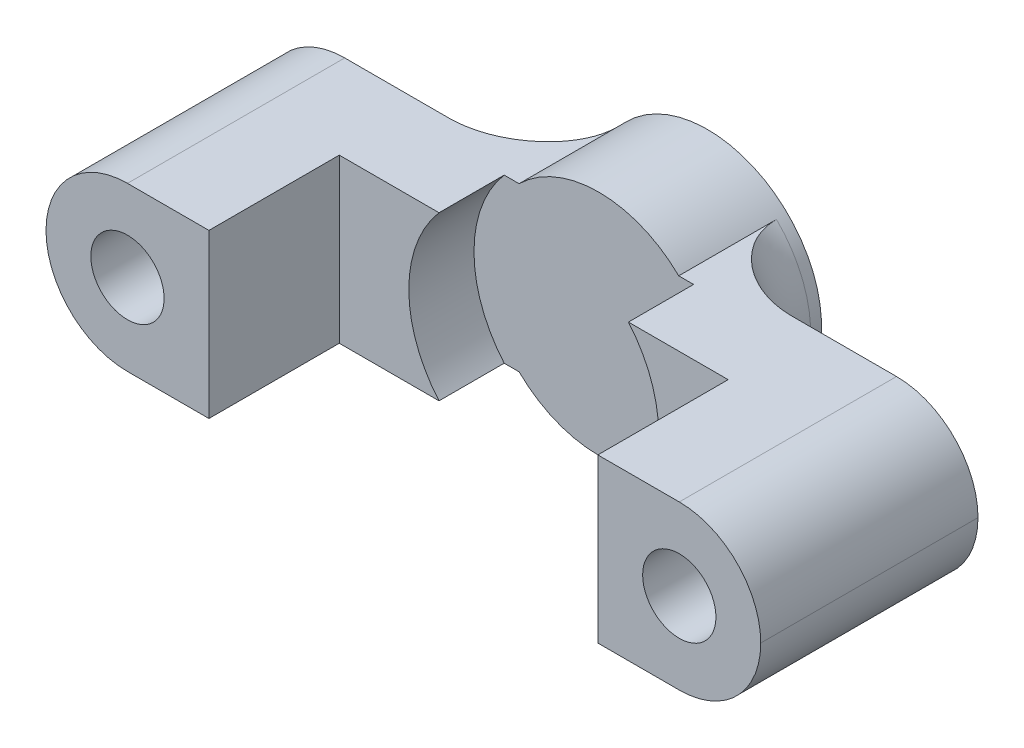
ISO-10303-21;
HEADER;
FILE_DESCRIPTION(('STEP AP214'),'2;1');
FILE_NAME('part.step','',(''),(''),'','','');
FILE_SCHEMA(('AUTOMOTIVE_DESIGN { 1 0 10303 214 1 1 1 1 }'));
ENDSEC;
DATA;
#1=APPLICATION_CONTEXT('core data for automotive mechanical design processes');
#2=APPLICATION_PROTOCOL_DEFINITION('international standard','automotive_design',2000,#1);
#3=PRODUCT_CONTEXT('',#1,'mechanical');
#4=PRODUCT('Part','Part','',(#3));
#5=PRODUCT_RELATED_PRODUCT_CATEGORY('part','',(#4));
#6=PRODUCT_DEFINITION_FORMATION('','',#4);
#7=PRODUCT_DEFINITION_CONTEXT('part definition',#1,'design');
#8=PRODUCT_DEFINITION('design','',#6,#7);
#9=PRODUCT_DEFINITION_SHAPE('','',#8);
#10=(LENGTH_UNIT() NAMED_UNIT(*) SI_UNIT(.MILLI.,.METRE.));
#11=(NAMED_UNIT(*) PLANE_ANGLE_UNIT() SI_UNIT($,.RADIAN.));
#12=(NAMED_UNIT(*) SI_UNIT($,.STERADIAN.) SOLID_ANGLE_UNIT());
#13=UNCERTAINTY_MEASURE_WITH_UNIT(LENGTH_MEASURE(1.E-05),#10,'distance_accuracy_value','');
#14=(GEOMETRIC_REPRESENTATION_CONTEXT(3) GLOBAL_UNCERTAINTY_ASSIGNED_CONTEXT((#13)) GLOBAL_UNIT_ASSIGNED_CONTEXT((#10,
#11,#12)) REPRESENTATION_CONTEXT('',''));
#15=CARTESIAN_POINT('',(0.,0.,0.));
#16=DIRECTION('',(0.,0.,1.));
#17=DIRECTION('',(1.,0.,0.));
#18=AXIS2_PLACEMENT_3D('',#15,#16,#17);
#19=CARTESIAN_POINT('',(0.,-7.5,6.));
#20=DIRECTION('',(0.,1.,0.));
#21=DIRECTION('',(-1.,0.,0.));
#22=AXIS2_PLACEMENT_3D('',#19,#20,#21);
#23=PLANE('',#22);
#24=DIRECTION('',(-1.,0.,0.));
#25=VECTOR('',#24,1.);
#26=CARTESIAN_POINT('',(-17.9,-7.5,18.));
#27=LINE('',#26,#25);
#28=CARTESIAN_POINT('',(-17.9,-7.5,18.));
#29=VERTEX_POINT('',#28);
#30=CARTESIAN_POINT('',(-25.4,-7.5,18.));
#31=VERTEX_POINT('',#30);
#32=EDGE_CURVE('E172',#29,#31,#27,.T.);
#33=ORIENTED_EDGE('',*,*,#32,.T.);
#34=DIRECTION('',(0.,0.,-1.));
#35=VECTOR('',#34,1.);
#36=CARTESIAN_POINT('',(-25.4,-7.50000000000001,-2.));
#37=LINE('',#36,#35);
#38=CARTESIAN_POINT('',(-25.4,-7.50000000000001,-2.));
#39=VERTEX_POINT('',#38);
#40=EDGE_CURVE('E11',#31,#39,#37,.T.);
#41=ORIENTED_EDGE('',*,*,#40,.T.);
#42=DIRECTION('',(-1.,0.,0.));
#43=VECTOR('',#42,1.);
#44=CARTESIAN_POINT('',(0.,-7.5,-2.));
#45=LINE('',#44,#43);
#46=CARTESIAN_POINT('',(-15.8113883008419,-7.50000000000001,-2.));
#47=VERTEX_POINT('',#46);
#48=EDGE_CURVE('E262',#47,#39,#45,.T.);
#49=ORIENTED_EDGE('',*,*,#48,.F.);
#50=CARTESIAN_POINT('',(-15.8113883008419,-7.50000000000001,-2.));
#51=CARTESIAN_POINT('',(-15.5111239041793,-7.50000000000001,-1.99996641057662));
#52=CARTESIAN_POINT('',(-15.2109687289218,-7.50000000000001,-2.01576753830129));
#53=CARTESIAN_POINT('',(-14.6139627616125,-7.50000000000001,-2.07775044445183));
#54=CARTESIAN_POINT('',(-14.3171102379921,-7.50000000000001,-2.12391545809045));
#55=CARTESIAN_POINT('',(-13.730255359878,-7.50000000000001,-2.24517532848181));
#56=CARTESIAN_POINT('',(-13.4402365981714,-7.50000000000001,-2.32019131617962));
#57=CARTESIAN_POINT('',(-12.8687734606911,-7.50000000000001,-2.49777186141323));
#58=CARTESIAN_POINT('',(-12.5873289939449,-7.5,-2.60033612655079));
#59=CARTESIAN_POINT('',(-12.0769756408679,-7.5,-2.81423888524928));
#60=CARTESIAN_POINT('',(-11.8465348158025,-7.5,-2.92193390077769));
#61=CARTESIAN_POINT('',(-11.3951202612077,-7.5,-3.15537140744996));
#62=CARTESIAN_POINT('',(-11.174145621985,-7.5,-3.28111215933743));
#63=CARTESIAN_POINT('',(-10.5272158178604,-7.5,-3.68461884827065));
#64=CARTESIAN_POINT('',(-10.1170057774989,-7.5,-3.98877368333062));
#65=CARTESIAN_POINT('',(-9.57836154411668,-7.5,-4.46435198921044));
#66=CARTESIAN_POINT('',(-9.42564782360673,-7.5,-4.6091367620679));
#67=CARTESIAN_POINT('',(-9.1313546339511,-7.5,-4.90972591721626));
#68=CARTESIAN_POINT('',(-8.98977518945814,-7.5,-5.06553032390458));
#69=CARTESIAN_POINT('',(-8.71957782035555,-7.5,-5.3876970946932));
#70=CARTESIAN_POINT('',(-8.59094332907156,-7.5,-5.55404550846774));
#71=CARTESIAN_POINT('',(-8.34839454888323,-7.5,-5.89713643002903));
#72=CARTESIAN_POINT('',(-8.23448136298089,-7.5,-6.07387971521531));
#73=CARTESIAN_POINT('',(-7.97156492092385,-7.5,-6.52738404360751));
#74=CARTESIAN_POINT('',(-7.83300471361881,-7.5,-6.81044271759455));
#75=CARTESIAN_POINT('',(-7.66101118734917,-7.5,-7.24844757806561));
#76=CARTESIAN_POINT('',(-7.60968777854708,-7.5,-7.39653135324657));
#77=CARTESIAN_POINT('',(-7.52001630855136,-7.5,-7.69655652277491));
#78=CARTESIAN_POINT('',(-7.48166282316097,-7.5,-7.84849627584848));
#79=CARTESIAN_POINT('',(-7.41680290008474,-7.5,-8.16582729639395));
#80=CARTESIAN_POINT('',(-7.39129091900108,-7.5,-8.33142577040719));
#81=CARTESIAN_POINT('',(-7.36565909923045,-7.5,-8.5812351389004));
#82=CARTESIAN_POINT('',(-7.35922108005593,-7.5,-8.66483749543803));
#83=CARTESIAN_POINT('',(-7.35062351775363,-7.5,-8.8322880713893));
#84=CARTESIAN_POINT('',(-7.34846532400768,-7.5,-8.91613636000045));
#85=CARTESIAN_POINT('',(-7.34846922834953,-7.5,-9.));
#86=B_SPLINE_CURVE_WITH_KNOTS('',3,(#50,#51,#52,#53,#54,#55,#56,#57,#58,#59,#60,#61,#62,#63,#64,
#65,#66,#67,#68,#69,#70,#71,#72,#73,#74,#75,#76,#77,#78,#79,#80,#81,#82,#83,#84,#85),
.UNSPECIFIED.,.F.,.F.,(4,2,2,2,2,2,2,2,2,2,2,2,2,2,2,2,2,4),(0.,0.900220551160631,
1.79994448106245,2.69722614648008,3.59449828849979,4.35673435874442,5.11889701360015,
6.64242071372978,7.27333848039395,7.90425764395192,8.53435881848733,9.16450717636569,
10.1057748576448,10.5754749523131,11.0449783684349,11.5467242666904,11.7981782174579,
12.0497114362907),.UNSPECIFIED.);
#87=CARTESIAN_POINT('',(-7.34846922834953,-7.5,-9.));
#88=VERTEX_POINT('',#87);
#89=EDGE_CURVE('E307',#47,#88,#86,.T.);
#90=ORIENTED_EDGE('',*,*,#89,.T.);
#91=DIRECTION('',(0.,0.,-1.));
#92=VECTOR('',#91,1.);
#93=CARTESIAN_POINT('',(-7.34846922834953,-7.5,0.));
#94=LINE('',#93,#92);
#95=CARTESIAN_POINT('',(-7.34846922834953,-7.5,0.));
#96=VERTEX_POINT('',#95);
#97=EDGE_CURVE('E239',#88,#96,#94,.F.);
#98=ORIENTED_EDGE('',*,*,#97,.T.);
#99=DIRECTION('',(-1.,0.,0.));
#100=VECTOR('',#99,1.);
#101=CARTESIAN_POINT('',(0.,-7.5,0.));
#102=LINE('',#101,#100);
#103=CARTESIAN_POINT('',(-8.71779788708134,-7.5,0.));
#104=VERTEX_POINT('',#103);
#105=EDGE_CURVE('E258',#96,#104,#102,.T.);
#106=ORIENTED_EDGE('',*,*,#105,.T.);
#107=DIRECTION('',(0.,0.,-1.));
#108=VECTOR('',#107,1.);
#109=CARTESIAN_POINT('',(-8.71779788708134,-7.5,6.));
#110=LINE('',#109,#108);
#111=CARTESIAN_POINT('',(-8.71779788708134,-7.5,6.));
#112=VERTEX_POINT('',#111);
#113=EDGE_CURVE('E251',#112,#104,#110,.T.);
#114=ORIENTED_EDGE('',*,*,#113,.F.);
#115=DIRECTION('',(1.,0.,0.));
#116=VECTOR('',#115,1.);
#117=CARTESIAN_POINT('',(0.,-7.5,6.));
#118=LINE('',#117,#116);
#119=CARTESIAN_POINT('',(-17.9,-7.50000000000001,6.));
#120=VERTEX_POINT('',#119);
#121=EDGE_CURVE('E175',#120,#112,#118,.T.);
#122=ORIENTED_EDGE('',*,*,#121,.F.);
#123=DIRECTION('',(0.,0.,-1.));
#124=VECTOR('',#123,1.);
#125=CARTESIAN_POINT('',(-17.9,-7.5,18.));
#126=LINE('',#125,#124);
#127=EDGE_CURVE('E171',#29,#120,#126,.T.);
#128=ORIENTED_EDGE('',*,*,#127,.F.);
#129=EDGE_LOOP('',(#33,#41,#49,#90,#98,#106,#114,#122,#128));
#130=FACE_BOUND('',#129,.T.);
#131=ADVANCED_FACE('F36',(#130),#23,.F.);
#132=CARTESIAN_POINT('',(0.,7.50000000000001,6.));
#133=DIRECTION('',(0.,1.,0.));
#134=DIRECTION('',(0.,0.,1.));
#135=AXIS2_PLACEMENT_3D('',#132,#133,#134);
#136=PLANE('',#135);
#137=DIRECTION('',(1.,0.,0.));
#138=VECTOR('',#137,1.);
#139=CARTESIAN_POINT('',(0.,7.50000000000001,-2.));
#140=LINE('',#139,#138);
#141=CARTESIAN_POINT('',(-25.4,7.50000000000001,-2.));
#142=VERTEX_POINT('',#141);
#143=CARTESIAN_POINT('',(-15.8113883008419,7.50000000000001,-2.));
#144=VERTEX_POINT('',#143);
#145=EDGE_CURVE('E263',#142,#144,#140,.T.);
#146=ORIENTED_EDGE('',*,*,#145,.F.);
#147=DIRECTION('',(0.,0.,-1.));
#148=VECTOR('',#147,1.);
#149=CARTESIAN_POINT('',(-25.4,7.50000000000001,6.));
#150=LINE('',#149,#148);
#151=CARTESIAN_POINT('',(-25.4,7.5,18.));
#152=VERTEX_POINT('',#151);
#153=EDGE_CURVE('E408',#142,#152,#150,.F.);
#154=ORIENTED_EDGE('',*,*,#153,.T.);
#155=DIRECTION('',(1.,0.,0.));
#156=VECTOR('',#155,1.);
#157=CARTESIAN_POINT('',(-17.9,7.5,18.));
#158=LINE('',#157,#156);
#159=CARTESIAN_POINT('',(-17.9,7.5,18.));
#160=VERTEX_POINT('',#159);
#161=EDGE_CURVE('E190',#152,#160,#158,.T.);
#162=ORIENTED_EDGE('',*,*,#161,.T.);
#163=DIRECTION('',(0.,0.,-1.));
#164=VECTOR('',#163,1.);
#165=CARTESIAN_POINT('',(-17.9,7.5,18.));
#166=LINE('',#165,#164);
#167=CARTESIAN_POINT('',(-17.9,7.5,6.));
#168=VERTEX_POINT('',#167);
#169=EDGE_CURVE('E181',#160,#168,#166,.T.);
#170=ORIENTED_EDGE('',*,*,#169,.T.);
#171=DIRECTION('',(1.,0.,0.));
#172=VECTOR('',#171,1.);
#173=CARTESIAN_POINT('',(0.,7.50000000000001,6.));
#174=LINE('',#173,#172);
#175=CARTESIAN_POINT('',(-8.71779788708134,7.50000000000001,6.));
#176=VERTEX_POINT('',#175);
#177=EDGE_CURVE('E248',#168,#176,#174,.T.);
#178=ORIENTED_EDGE('',*,*,#177,.T.);
#179=DIRECTION('',(0.,0.,-1.));
#180=VECTOR('',#179,1.);
#181=CARTESIAN_POINT('',(-8.71779788708134,7.50000000000001,6.));
#182=LINE('',#181,#180);
#183=CARTESIAN_POINT('',(-8.71779788708134,7.50000000000001,0.));
#184=VERTEX_POINT('',#183);
#185=EDGE_CURVE('E256',#176,#184,#182,.T.);
#186=ORIENTED_EDGE('',*,*,#185,.T.);
#187=DIRECTION('',(1.,0.,0.));
#188=VECTOR('',#187,1.);
#189=CARTESIAN_POINT('',(0.,7.50000000000001,0.));
#190=LINE('',#189,#188);
#191=CARTESIAN_POINT('',(-7.34846922834952,7.50000000000001,0.));
#192=VERTEX_POINT('',#191);
#193=EDGE_CURVE('E270',#184,#192,#190,.T.);
#194=ORIENTED_EDGE('',*,*,#193,.T.);
#195=DIRECTION('',(0.,0.,-1.));
#196=VECTOR('',#195,1.);
#197=CARTESIAN_POINT('',(-7.34846922834952,7.50000000000001,0.));
#198=LINE('',#197,#196);
#199=CARTESIAN_POINT('',(-7.34846922834952,7.50000000000001,-9.));
#200=VERTEX_POINT('',#199);
#201=EDGE_CURVE('E235',#200,#192,#198,.F.);
#202=ORIENTED_EDGE('',*,*,#201,.F.);
#203=CARTESIAN_POINT('',(-7.34846922834952,7.50000000000001,-9.));
#204=CARTESIAN_POINT('',(-7.34846568846636,7.50000000000001,-8.91798387331253));
#205=CARTESIAN_POINT('',(-7.3505296304595,7.50000000000001,-8.83598201308874));
#206=CARTESIAN_POINT('',(-7.35875402902435,7.50000000000001,-8.67219208531857));
#207=CARTESIAN_POINT('',(-7.36491406965228,7.50000000000001,-8.59040399691095));
#208=CARTESIAN_POINT('',(-7.38945435270717,7.50000000000001,-8.34588184444658));
#209=CARTESIAN_POINT('',(-7.41389501835498,7.50000000000001,-8.18371875453255));
#210=CARTESIAN_POINT('',(-7.47777934195556,7.50000000000001,-7.86432127919843));
#211=CARTESIAN_POINT('',(-7.517051823679,7.50000000000001,-7.7070520276216));
#212=CARTESIAN_POINT('',(-7.60949384995337,7.50000000000001,-7.39662221557643));
#213=CARTESIAN_POINT('',(-7.66266759134817,7.50000000000001,-7.24346291134076));
#214=CARTESIAN_POINT('',(-7.78128009466701,7.50000000000001,-6.94297950522702));
#215=CARTESIAN_POINT('',(-7.84664895793192,7.50000000000001,-6.79562767461401));
#216=CARTESIAN_POINT('',(-7.98853188649418,7.50000000000001,-6.50646077783094));
#217=CARTESIAN_POINT('',(-8.06504516671019,7.50000000000001,-6.36464532253613));
#218=CARTESIAN_POINT('',(-8.31007112292304,7.50000000000001,-5.94704456847047));
#219=CARTESIAN_POINT('',(-8.49370703196581,7.50000000000001,-5.67999320650892));
#220=CARTESIAN_POINT('',(-8.84142061398073,7.50000000000001,-5.23666507103636));
#221=CARTESIAN_POINT('',(-8.99842050394498,7.50000000000001,-5.05468236363742));
#222=CARTESIAN_POINT('',(-9.32759039937044,7.50000000000001,-4.70483651118266));
#223=CARTESIAN_POINT('',(-9.49976626127,7.50000000000001,-4.53697886629279));
#224=CARTESIAN_POINT('',(-9.8573107348156,7.50000000000001,-4.2157202705409));
#225=CARTESIAN_POINT('',(-10.04268910884,7.50000000000001,-4.06233021644076));
#226=CARTESIAN_POINT('',(-10.4248008827629,7.50000000000001,-3.77057512454829));
#227=CARTESIAN_POINT('',(-10.6215329039661,7.50000000000001,-3.63220826831506));
#228=CARTESIAN_POINT('',(-11.2329917900934,7.50000000000001,-3.23623671008573));
#229=CARTESIAN_POINT('',(-11.6635789981935,7.50000000000001,-3.00257620051733));
#230=CARTESIAN_POINT('',(-12.5547350230472,7.50000000000001,-2.60448842003765));
#231=CARTESIAN_POINT('',(-13.0152584463791,7.50000000000001,-2.43995902583837));
#232=CARTESIAN_POINT('',(-13.8643504408079,7.50000000000001,-2.2104014994316));
#233=CARTESIAN_POINT('',(-14.2493527598562,7.50000000000001,-2.13219880824697));
#234=CARTESIAN_POINT('',(-14.8320939828657,7.50000000000001,-2.05329287399561));
#235=CARTESIAN_POINT('',(-15.0273622419289,7.50000000000001,-2.03339009580765));
#236=CARTESIAN_POINT('',(-15.4188608707121,7.50000000000001,-2.00674146844548));
#237=CARTESIAN_POINT('',(-15.6150915558276,7.50000000000001,-2.00000026778783));
#238=CARTESIAN_POINT('',(-15.8113883008419,7.50000000000001,-2.));
#239=B_SPLINE_CURVE_WITH_KNOTS('',3,(#203,#204,#205,#206,#207,#208,#209,#210,#211,#212,#213,
#214,#215,#216,#217,#218,#219,#220,#221,#222,#223,#224,#225,#226,#227,#228,#229,#230,#231,#232,
#233,#234,#235,#236,#237,#238),.UNSPECIFIED.,.F.,.F.,(4,2,2,2,2,2,2,2,2,2,2,2,2,2,2,2,2,4),(0.,
0.245994568656017,0.491964161280957,0.983093595597821,1.46871995222198,1.95449309096537,
2.43756301288391,2.92059892082683,3.88952188731617,4.60975197145831,5.33026122100562,
6.05130888424283,6.77226917275713,8.23566971123128,9.69690078931857,10.8720277984782,
11.4604734809979,12.0491269581397),.UNSPECIFIED.);
#240=EDGE_CURVE('E298',#200,#144,#239,.T.);
#241=ORIENTED_EDGE('',*,*,#240,.T.);
#242=EDGE_LOOP('',(#146,#154,#162,#170,#178,#186,#194,#202,#241));
#243=FACE_BOUND('',#242,.T.);
#244=ADVANCED_FACE('F318',(#243),#136,.T.);
#245=CARTESIAN_POINT('',(0.,0.,-2.));
#246=DIRECTION('',(0.,0.,-1.));
#247=DIRECTION('',(-1.,0.,0.));
#248=AXIS2_PLACEMENT_3D('',#245,#246,#247);
#249=PLANE('',#248);
#250=CARTESIAN_POINT('',(-25.4,0.,-2.));
#251=DIRECTION('',(0.,0.,1.));
#252=DIRECTION('',(1.,0.,0.));
#253=AXIS2_PLACEMENT_3D('',#250,#251,#252);
#254=CIRCLE('',#253,5.5);
#255=CARTESIAN_POINT('',(-19.9,0.,-2.));
#256=VERTEX_POINT('',#255);
#257=EDGE_CURVE('E413',#256,#256,#254,.T.);
#258=ORIENTED_EDGE('',*,*,#257,.T.);
#259=EDGE_LOOP('',(#258));
#260=FACE_BOUND('',#259,.T.);
#261=CARTESIAN_POINT('',(-25.4,0.,-2.));
#262=DIRECTION('',(0.,0.,-1.));
#263=DIRECTION('',(-1.,0.,0.));
#264=AXIS2_PLACEMENT_3D('',#261,#262,#263);
#265=CIRCLE('',#264,7.5);
#266=CARTESIAN_POINT('',(-32.9,0.,-2.));
#267=VERTEX_POINT('',#266);
#268=EDGE_CURVE('E404',#39,#267,#265,.T.);
#269=ORIENTED_EDGE('',*,*,#268,.T.);
#270=CARTESIAN_POINT('',(-25.4,0.,-2.));
#271=DIRECTION('',(0.,0.,-1.));
#272=DIRECTION('',(-1.,0.,0.));
#273=AXIS2_PLACEMENT_3D('',#270,#271,#272);
#274=CIRCLE('',#273,7.5);
#275=EDGE_CURVE('E406',#267,#142,#274,.T.);
#276=ORIENTED_EDGE('',*,*,#275,.T.);
#277=ORIENTED_EDGE('',*,*,#145,.T.);
#278=CARTESIAN_POINT('',(0.,0.,-2.));
#279=DIRECTION('',(0.,0.,-1.));
#280=DIRECTION('',(-1.,0.,0.));
#281=AXIS2_PLACEMENT_3D('',#278,#279,#280);
#282=CIRCLE('',#281,17.5);
#283=EDGE_CURVE('E294',#144,#47,#282,.F.);
#284=ORIENTED_EDGE('',*,*,#283,.T.);
#285=ORIENTED_EDGE('',*,*,#48,.T.);
#286=EDGE_LOOP('',(#269,#276,#277,#284,#285));
#287=FACE_BOUND('',#286,.T.);
#288=ADVANCED_FACE('F322',(#260,#287),#249,.T.);
#289=CARTESIAN_POINT('',(-25.4,0.,-2.));
#290=DIRECTION('',(0.,0.,1.));
#291=DIRECTION('',(1.,0.,0.));
#292=AXIS2_PLACEMENT_3D('',#289,#290,#291);
#293=CYLINDRICAL_SURFACE('',#292,3.3734375);
#294=CARTESIAN_POINT('',(-25.4,0.,18.));
#295=DIRECTION('',(0.,0.,-1.));
#296=DIRECTION('',(-1.,0.,0.));
#297=AXIS2_PLACEMENT_3D('',#294,#295,#296);
#298=CIRCLE('',#297,3.3734375);
#299=CARTESIAN_POINT('',(-28.7734375,0.,18.));
#300=VERTEX_POINT('',#299);
#301=EDGE_CURVE('E196',#300,#300,#298,.T.);
#302=ORIENTED_EDGE('',*,*,#301,.F.);
#303=EDGE_LOOP('',(#302));
#304=FACE_BOUND('',#303,.T.);
#305=CARTESIAN_POINT('',(-25.4,0.,13.));
#306=DIRECTION('',(0.,0.,-1.));
#307=DIRECTION('',(-1.,0.,0.));
#308=AXIS2_PLACEMENT_3D('',#305,#306,#307);
#309=CIRCLE('',#308,3.3734375);
#310=CARTESIAN_POINT('',(-28.7734375,0.,13.));
#311=VERTEX_POINT('',#310);
#312=EDGE_CURVE('E472',#311,#311,#309,.T.);
#313=ORIENTED_EDGE('',*,*,#312,.T.);
#314=EDGE_LOOP('',(#313));
#315=FACE_BOUND('',#314,.T.);
#316=ADVANCED_FACE('F525',(#304,#315),#293,.F.);
#317=CARTESIAN_POINT('',(0.,0.,6.));
#318=DIRECTION('',(0.,0.,1.));
#319=DIRECTION('',(1.,0.,0.));
#320=AXIS2_PLACEMENT_3D('',#317,#318,#319);
#321=PLANE('',#320);
#322=ORIENTED_EDGE('',*,*,#177,.F.);
#323=DIRECTION('',(0.,-1.,0.));
#324=VECTOR('',#323,1.);
#325=CARTESIAN_POINT('',(-17.9,7.5,6.));
#326=LINE('',#325,#324);
#327=EDGE_CURVE('E186',#168,#120,#326,.T.);
#328=ORIENTED_EDGE('',*,*,#327,.T.);
#329=ORIENTED_EDGE('',*,*,#121,.T.);
#330=CARTESIAN_POINT('',(0.,0.,6.));
#331=DIRECTION('',(0.,0.,1.));
#332=DIRECTION('',(1.,0.,0.));
#333=AXIS2_PLACEMENT_3D('',#330,#331,#332);
#334=CIRCLE('',#333,11.5);
#335=EDGE_CURVE('E245',#176,#112,#334,.T.);
#336=ORIENTED_EDGE('',*,*,#335,.F.);
#337=EDGE_LOOP('',(#322,#328,#329,#336));
#338=FACE_BOUND('',#337,.T.);
#339=ADVANCED_FACE('F448',(#338),#321,.T.);
#340=CARTESIAN_POINT('',(25.4,0.,6.));
#341=DIRECTION('',(0.,0.,-1.));
#342=DIRECTION('',(-1.,0.,0.));
#343=AXIS2_PLACEMENT_3D('',#340,#341,#342);
#344=CYLINDRICAL_SURFACE('',#343,3.3734375);
#345=CARTESIAN_POINT('',(25.4,0.,18.));
#346=DIRECTION('',(0.,0.,1.));
#347=DIRECTION('',(1.,0.,0.));
#348=AXIS2_PLACEMENT_3D('',#345,#346,#347);
#349=CIRCLE('',#348,3.3734375);
#350=CARTESIAN_POINT('',(28.7734375,0.,18.));
#351=VERTEX_POINT('',#350);
#352=EDGE_CURVE('E204',#351,#351,#349,.T.);
#353=ORIENTED_EDGE('',*,*,#352,.T.);
#354=EDGE_LOOP('',(#353));
#355=FACE_BOUND('',#354,.T.);
#356=CARTESIAN_POINT('',(25.4,0.,13.));
#357=DIRECTION('',(0.,0.,-1.));
#358=DIRECTION('',(-1.,0.,0.));
#359=AXIS2_PLACEMENT_3D('',#356,#357,#358);
#360=CIRCLE('',#359,3.3734375);
#361=CARTESIAN_POINT('',(22.0265625,0.,13.));
#362=VERTEX_POINT('',#361);
#363=EDGE_CURVE('E201',#362,#362,#360,.T.);
#364=ORIENTED_EDGE('',*,*,#363,.T.);
#365=EDGE_LOOP('',(#364));
#366=FACE_BOUND('',#365,.T.);
#367=ADVANCED_FACE('F380',(#355,#366),#344,.F.);
#368=CARTESIAN_POINT('',(25.4,0.,-2.));
#369=DIRECTION('',(0.,0.,-1.));
#370=DIRECTION('',(-1.,0.,0.));
#371=AXIS2_PLACEMENT_3D('',#368,#369,#370);
#372=CIRCLE('',#371,7.5);
#373=CARTESIAN_POINT('',(25.4,7.50000000000001,-2.));
#374=VERTEX_POINT('',#373);
#375=CARTESIAN_POINT('',(32.9,0.,-2.));
#376=VERTEX_POINT('',#375);
#377=EDGE_CURVE('E338',#374,#376,#372,.T.);
#378=ORIENTED_EDGE('',*,*,#377,.T.);
#379=CARTESIAN_POINT('',(25.4,0.,-2.));
#380=DIRECTION('',(0.,0.,-1.));
#381=DIRECTION('',(-1.,0.,0.));
#382=AXIS2_PLACEMENT_3D('',#379,#380,#381);
#383=CIRCLE('',#382,7.5);
#384=CARTESIAN_POINT('',(25.4,-7.49999999999999,-2.));
#385=VERTEX_POINT('',#384);
#386=EDGE_CURVE('E393',#376,#385,#383,.T.);
#387=ORIENTED_EDGE('',*,*,#386,.T.);
#388=CARTESIAN_POINT('',(15.8113883008419,-7.49999999999999,-2.));
#389=VERTEX_POINT('',#388);
#390=EDGE_CURVE('E259',#385,#389,#45,.T.);
#391=ORIENTED_EDGE('',*,*,#390,.T.);
#392=CARTESIAN_POINT('',(0.,0.,-2.));
#393=DIRECTION('',(0.,0.,-1.));
#394=DIRECTION('',(-1.,0.,0.));
#395=AXIS2_PLACEMENT_3D('',#392,#393,#394);
#396=CIRCLE('',#395,17.5);
#397=CARTESIAN_POINT('',(15.8113883008419,7.50000000000001,-2.));
#398=VERTEX_POINT('',#397);
#399=EDGE_CURVE('E296',#389,#398,#396,.F.);
#400=ORIENTED_EDGE('',*,*,#399,.T.);
#401=EDGE_CURVE('E261',#398,#374,#140,.T.);
#402=ORIENTED_EDGE('',*,*,#401,.T.);
#403=EDGE_LOOP('',(#378,#387,#391,#400,#402));
#404=FACE_BOUND('',#403,.T.);
#405=CARTESIAN_POINT('',(25.4,0.,-2.));
#406=DIRECTION('',(0.,0.,-1.));
#407=DIRECTION('',(-1.,0.,0.));
#408=AXIS2_PLACEMENT_3D('',#405,#406,#407);
#409=CIRCLE('',#408,5.5);
#410=CARTESIAN_POINT('',(19.9,0.,-2.));
#411=VERTEX_POINT('',#410);
#412=EDGE_CURVE('E180',#411,#411,#409,.T.);
#413=ORIENTED_EDGE('',*,*,#412,.F.);
#414=EDGE_LOOP('',(#413));
#415=FACE_BOUND('',#414,.T.);
#416=ADVANCED_FACE('F372',(#404,#415),#249,.T.);
#417=ORIENTED_EDGE('',*,*,#390,.F.);
#418=DIRECTION('',(0.,0.,-1.));
#419=VECTOR('',#418,1.);
#420=CARTESIAN_POINT('',(25.4,-7.49999999999999,6.));
#421=LINE('',#420,#419);
#422=CARTESIAN_POINT('',(25.4,-7.5,18.));
#423=VERTEX_POINT('',#422);
#424=EDGE_CURVE('E388',#385,#423,#421,.F.);
#425=ORIENTED_EDGE('',*,*,#424,.T.);
#426=DIRECTION('',(1.,0.,0.));
#427=VECTOR('',#426,1.);
#428=CARTESIAN_POINT('',(17.9,-7.5,18.));
#429=LINE('',#428,#427);
#430=CARTESIAN_POINT('',(17.9,-7.5,18.));
#431=VERTEX_POINT('',#430);
#432=EDGE_CURVE('E212',#431,#423,#429,.T.);
#433=ORIENTED_EDGE('',*,*,#432,.F.);
#434=DIRECTION('',(0.,0.,-1.));
#435=VECTOR('',#434,1.);
#436=CARTESIAN_POINT('',(17.9,-7.5,18.));
#437=LINE('',#436,#435);
#438=CARTESIAN_POINT('',(17.9,-7.5,6.));
#439=VERTEX_POINT('',#438);
#440=EDGE_CURVE('E215',#431,#439,#437,.T.);
#441=ORIENTED_EDGE('',*,*,#440,.T.);
#442=DIRECTION('',(1.,0.,0.));
#443=VECTOR('',#442,1.);
#444=CARTESIAN_POINT('',(0.,-7.5,6.));
#445=LINE('',#444,#443);
#446=CARTESIAN_POINT('',(8.71779788708135,-7.5,6.));
#447=VERTEX_POINT('',#446);
#448=EDGE_CURVE('E276',#447,#439,#445,.T.);
#449=ORIENTED_EDGE('',*,*,#448,.F.);
#450=DIRECTION('',(0.,0.,-1.));
#451=VECTOR('',#450,1.);
#452=CARTESIAN_POINT('',(8.71779788708135,-7.5,6.));
#453=LINE('',#452,#451);
#454=CARTESIAN_POINT('',(8.71779788708135,-7.5,0.));
#455=VERTEX_POINT('',#454);
#456=EDGE_CURVE('E286',#447,#455,#453,.T.);
#457=ORIENTED_EDGE('',*,*,#456,.T.);
#458=CARTESIAN_POINT('',(7.34846922834954,-7.5,0.));
#459=VERTEX_POINT('',#458);
#460=EDGE_CURVE('E266',#455,#459,#102,.T.);
#461=ORIENTED_EDGE('',*,*,#460,.T.);
#462=DIRECTION('',(0.,0.,-1.));
#463=VECTOR('',#462,1.);
#464=CARTESIAN_POINT('',(7.34846922834954,-7.5,0.));
#465=LINE('',#464,#463);
#466=CARTESIAN_POINT('',(7.34846922834954,-7.5,-9.));
#467=VERTEX_POINT('',#466);
#468=EDGE_CURVE('E242',#459,#467,#465,.T.);
#469=ORIENTED_EDGE('',*,*,#468,.T.);
#470=CARTESIAN_POINT('',(7.34846922834954,-7.5,-9.));
#471=CARTESIAN_POINT('',(7.34846568846638,-7.5,-8.91798387331253));
#472=CARTESIAN_POINT('',(7.35052963045952,-7.5,-8.83598201308874));
#473=CARTESIAN_POINT('',(7.35875402902437,-7.5,-8.67219208531857));
#474=CARTESIAN_POINT('',(7.3649140696523,-7.5,-8.59040399691095));
#475=CARTESIAN_POINT('',(7.38945435270719,-7.5,-8.34588184444658));
#476=CARTESIAN_POINT('',(7.413895018355,-7.5,-8.18371875453255));
#477=CARTESIAN_POINT('',(7.47777934195558,-7.5,-7.86432127919843));
#478=CARTESIAN_POINT('',(7.51705182367901,-7.5,-7.7070520276216));
#479=CARTESIAN_POINT('',(7.60949384995339,-7.5,-7.39662221557643));
#480=CARTESIAN_POINT('',(7.66266759134819,-7.5,-7.24346291134076));
#481=CARTESIAN_POINT('',(7.78128009466703,-7.5,-6.94297950522701));
#482=CARTESIAN_POINT('',(7.84664895793193,-7.5,-6.795627674614));
#483=CARTESIAN_POINT('',(7.9885318864942,-7.5,-6.50646077783094));
#484=CARTESIAN_POINT('',(8.06504516671021,-7.5,-6.36464532253613));
#485=CARTESIAN_POINT('',(8.31007112292307,-7.5,-5.94704456847046));
#486=CARTESIAN_POINT('',(8.49370703196583,-7.5,-5.67999320650892));
#487=CARTESIAN_POINT('',(8.84142061398075,-7.5,-5.23666507103635));
#488=CARTESIAN_POINT('',(8.99842050394499,-7.5,-5.05468236363742));
#489=CARTESIAN_POINT('',(9.32759039937046,-7.5,-4.70483651118265));
#490=CARTESIAN_POINT('',(9.49976626127002,-7.5,-4.53697886629279));
#491=CARTESIAN_POINT('',(9.85731073481562,-7.5,-4.21572027054089));
#492=CARTESIAN_POINT('',(10.04268910884,-7.5,-4.06233021644075));
#493=CARTESIAN_POINT('',(10.4248008827629,-7.5,-3.77057512454829));
#494=CARTESIAN_POINT('',(10.6215329039662,-7.5,-3.63220826831505));
#495=CARTESIAN_POINT('',(11.2329917900935,-7.5,-3.23623671008572));
#496=CARTESIAN_POINT('',(11.6635789981935,-7.5,-3.00257620051733));
#497=CARTESIAN_POINT('',(12.5547350230472,-7.5,-2.60448842003765));
#498=CARTESIAN_POINT('',(13.0152584463791,-7.49999999999999,-2.43995902583837));
#499=CARTESIAN_POINT('',(13.8643504408079,-7.49999999999999,-2.2104014994316));
#500=CARTESIAN_POINT('',(14.2493527598563,-7.49999999999999,-2.13219880824697));
#501=CARTESIAN_POINT('',(14.8320939828657,-7.49999999999999,-2.05329287399561));
#502=CARTESIAN_POINT('',(15.0273622419289,-7.49999999999999,-2.03339009580765));
#503=CARTESIAN_POINT('',(15.4188608707121,-7.49999999999999,-2.00674146844548));
#504=CARTESIAN_POINT('',(15.6150915558277,-7.49999999999999,-2.00000026778783));
#505=CARTESIAN_POINT('',(15.8113883008419,-7.49999999999999,-2.));
#506=B_SPLINE_CURVE_WITH_KNOTS('',3,(#470,#471,#472,#473,#474,#475,#476,#477,#478,#479,#480,
#481,#482,#483,#484,#485,#486,#487,#488,#489,#490,#491,#492,#493,#494,#495,#496,#497,#498,#499,
#500,#501,#502,#503,#504,#505),.UNSPECIFIED.,.F.,.F.,(4,2,2,2,2,2,2,2,2,2,2,2,2,2,2,2,2,4),(0.,
0.245994568656017,0.491964161280957,0.983093595597821,1.46871995222199,1.95449309096538,
2.43756301288391,2.92059892082683,3.88952188731618,4.60975197145832,5.33026122100563,
6.05130888424284,6.77226917275714,8.2356697112313,9.69690078931857,10.8720277984782,
11.4604734809979,12.0491269581397),.UNSPECIFIED.);
#507=EDGE_CURVE('E339',#467,#389,#506,.T.);
#508=ORIENTED_EDGE('',*,*,#507,.T.);
#509=EDGE_LOOP('',(#417,#425,#433,#441,#449,#457,#461,#469,#508));
#510=FACE_BOUND('',#509,.T.);
#511=ADVANCED_FACE('F368',(#510),#23,.F.);
#512=DIRECTION('',(-1.,0.,0.));
#513=VECTOR('',#512,1.);
#514=CARTESIAN_POINT('',(17.9,7.5,18.));
#515=LINE('',#514,#513);
#516=CARTESIAN_POINT('',(25.4,7.5,18.));
#517=VERTEX_POINT('',#516);
#518=CARTESIAN_POINT('',(17.9,7.5,18.));
#519=VERTEX_POINT('',#518);
#520=EDGE_CURVE('E208',#517,#519,#515,.T.);
#521=ORIENTED_EDGE('',*,*,#520,.F.);
#522=DIRECTION('',(0.,0.,-1.));
#523=VECTOR('',#522,1.);
#524=CARTESIAN_POINT('',(25.4,7.50000000000001,-2.));
#525=LINE('',#524,#523);
#526=EDGE_CURVE('E402',#517,#374,#525,.T.);
#527=ORIENTED_EDGE('',*,*,#526,.T.);
#528=ORIENTED_EDGE('',*,*,#401,.F.);
#529=CARTESIAN_POINT('',(15.8113883008419,7.50000000000001,-2.));
#530=CARTESIAN_POINT('',(15.5111239041793,7.50000000000001,-1.99996641057662));
#531=CARTESIAN_POINT('',(15.2109687289218,7.50000000000001,-2.01576753830129));
#532=CARTESIAN_POINT('',(14.6139627616125,7.50000000000001,-2.07775044445183));
#533=CARTESIAN_POINT('',(14.3171102379921,7.50000000000001,-2.12391545809045));
#534=CARTESIAN_POINT('',(13.730255359878,7.50000000000001,-2.24517532848181));
#535=CARTESIAN_POINT('',(13.4402365981714,7.50000000000001,-2.32019131617963));
#536=CARTESIAN_POINT('',(12.8687734606911,7.50000000000001,-2.49777186141323));
#537=CARTESIAN_POINT('',(12.5873289939449,7.50000000000001,-2.60033612655079));
#538=CARTESIAN_POINT('',(12.0769756408679,7.50000000000001,-2.81423888524928));
#539=CARTESIAN_POINT('',(11.8465348158025,7.50000000000001,-2.92193390077769));
#540=CARTESIAN_POINT('',(11.3951202612077,7.50000000000001,-3.15537140744995));
#541=CARTESIAN_POINT('',(11.174145621985,7.50000000000001,-3.28111215933743));
#542=CARTESIAN_POINT('',(10.5272158178604,7.50000000000001,-3.68461884827065));
#543=CARTESIAN_POINT('',(10.1170057774989,7.50000000000001,-3.98877368333062));
#544=CARTESIAN_POINT('',(9.57836154411667,7.50000000000001,-4.46435198921044));
#545=CARTESIAN_POINT('',(9.42564782360672,7.50000000000001,-4.6091367620679));
#546=CARTESIAN_POINT('',(9.13135463395109,7.50000000000001,-4.90972591721626));
#547=CARTESIAN_POINT('',(8.98977518945813,7.50000000000001,-5.06553032390458));
#548=CARTESIAN_POINT('',(8.71957782035554,7.50000000000001,-5.3876970946932));
#549=CARTESIAN_POINT('',(8.59094332907154,7.50000000000001,-5.55404550846774));
#550=CARTESIAN_POINT('',(8.34839454888322,7.50000000000001,-5.89713643002903));
#551=CARTESIAN_POINT('',(8.23448136298088,7.50000000000001,-6.07387971521531));
#552=CARTESIAN_POINT('',(7.97156492092384,7.50000000000001,-6.52738404360752));
#553=CARTESIAN_POINT('',(7.8330047136188,7.50000000000001,-6.81044271759456));
#554=CARTESIAN_POINT('',(7.66101118734916,7.50000000000001,-7.24844757806561));
#555=CARTESIAN_POINT('',(7.60968777854707,7.50000000000001,-7.39653135324657));
#556=CARTESIAN_POINT('',(7.52001630855135,7.50000000000001,-7.69655652277491));
#557=CARTESIAN_POINT('',(7.48166282316096,7.50000000000001,-7.84849627584848));
#558=CARTESIAN_POINT('',(7.41680290008473,7.50000000000001,-8.16582729639395));
#559=CARTESIAN_POINT('',(7.39129091900107,7.50000000000001,-8.33142577040719));
#560=CARTESIAN_POINT('',(7.36565909923043,7.50000000000001,-8.5812351389004));
#561=CARTESIAN_POINT('',(7.35922108005592,7.50000000000001,-8.66483749543803));
#562=CARTESIAN_POINT('',(7.35062351775362,7.50000000000001,-8.8322880713893));
#563=CARTESIAN_POINT('',(7.34846532400767,7.50000000000001,-8.91613636000045));
#564=CARTESIAN_POINT('',(7.34846922834952,7.50000000000001,-9.));
#565=B_SPLINE_CURVE_WITH_KNOTS('',3,(#529,#530,#531,#532,#533,#534,#535,#536,#537,#538,#539,
#540,#541,#542,#543,#544,#545,#546,#547,#548,#549,#550,#551,#552,#553,#554,#555,#556,#557,#558,
#559,#560,#561,#562,#563,#564),.UNSPECIFIED.,.F.,.F.,(4,2,2,2,2,2,2,2,2,2,2,2,2,2,2,2,2,4),(0.,
0.900220551160631,1.79994448106245,2.69722614648008,3.59449828849979,4.35673435874443,
5.11889701360015,6.64242071372979,7.27333848039396,7.90425764395193,8.53435881848734,
9.1645071763657,10.1057748576448,10.5754749523131,11.0449783684349,11.5467242666904,
11.7981782174579,12.0497114362907),.UNSPECIFIED.);
#566=CARTESIAN_POINT('',(7.34846922834952,7.50000000000001,-9.));
#567=VERTEX_POINT('',#566);
#568=EDGE_CURVE('E331',#398,#567,#565,.T.);
#569=ORIENTED_EDGE('',*,*,#568,.T.);
#570=DIRECTION('',(0.,0.,-1.));
#571=VECTOR('',#570,1.);
#572=CARTESIAN_POINT('',(7.34846922834952,7.50000000000001,0.));
#573=LINE('',#572,#571);
#574=CARTESIAN_POINT('',(7.34846922834952,7.50000000000001,0.));
#575=VERTEX_POINT('',#574);
#576=EDGE_CURVE('E237',#575,#567,#573,.T.);
#577=ORIENTED_EDGE('',*,*,#576,.F.);
#578=CARTESIAN_POINT('',(8.71779788708134,7.50000000000001,0.));
#579=VERTEX_POINT('',#578);
#580=EDGE_CURVE('E269',#575,#579,#190,.T.);
#581=ORIENTED_EDGE('',*,*,#580,.T.);
#582=DIRECTION('',(0.,0.,-1.));
#583=VECTOR('',#582,1.);
#584=CARTESIAN_POINT('',(8.71779788708134,7.50000000000001,6.));
#585=LINE('',#584,#583);
#586=CARTESIAN_POINT('',(8.71779788708134,7.50000000000001,6.));
#587=VERTEX_POINT('',#586);
#588=EDGE_CURVE('E281',#587,#579,#585,.T.);
#589=ORIENTED_EDGE('',*,*,#588,.F.);
#590=DIRECTION('',(1.,0.,0.));
#591=VECTOR('',#590,1.);
#592=CARTESIAN_POINT('',(0.,7.50000000000001,6.));
#593=LINE('',#592,#591);
#594=CARTESIAN_POINT('',(17.9,7.50000000000001,6.));
#595=VERTEX_POINT('',#594);
#596=EDGE_CURVE('E278',#587,#595,#593,.T.);
#597=ORIENTED_EDGE('',*,*,#596,.T.);
#598=DIRECTION('',(0.,0.,-1.));
#599=VECTOR('',#598,1.);
#600=CARTESIAN_POINT('',(17.9,7.5,18.));
#601=LINE('',#600,#599);
#602=EDGE_CURVE('E220',#519,#595,#601,.T.);
#603=ORIENTED_EDGE('',*,*,#602,.F.);
#604=EDGE_LOOP('',(#521,#527,#528,#569,#577,#581,#589,#597,#603));
#605=FACE_BOUND('',#604,.T.);
#606=ADVANCED_FACE('F324',(#605),#136,.T.);
#607=CARTESIAN_POINT('',(0.,0.,6.));
#608=DIRECTION('',(0.,0.,-1.));
#609=DIRECTION('',(-1.,0.,0.));
#610=AXIS2_PLACEMENT_3D('',#607,#608,#609);
#611=CYLINDRICAL_SURFACE('',#610,11.5);
#612=CARTESIAN_POINT('',(0.,0.,0.));
#613=DIRECTION('',(0.,0.,1.));
#614=DIRECTION('',(1.,0.,0.));
#615=AXIS2_PLACEMENT_3D('',#612,#613,#614);
#616=CIRCLE('',#615,11.5);
#617=EDGE_CURVE('E265',#455,#579,#616,.T.);
#618=ORIENTED_EDGE('',*,*,#617,.F.);
#619=ORIENTED_EDGE('',*,*,#456,.F.);
#620=CARTESIAN_POINT('',(0.,0.,6.));
#621=DIRECTION('',(0.,0.,1.));
#622=DIRECTION('',(1.,0.,0.));
#623=AXIS2_PLACEMENT_3D('',#620,#621,#622);
#624=CIRCLE('',#623,11.5);
#625=EDGE_CURVE('E273',#447,#587,#624,.T.);
#626=ORIENTED_EDGE('',*,*,#625,.T.);
#627=ORIENTED_EDGE('',*,*,#588,.T.);
#628=EDGE_LOOP('',(#618,#619,#626,#627));
#629=FACE_BOUND('',#628,.T.);
#630=ADVANCED_FACE('F378',(#629),#611,.F.);
#631=CARTESIAN_POINT('',(0.,0.,6.));
#632=DIRECTION('',(0.,0.,1.));
#633=DIRECTION('',(1.,0.,0.));
#634=AXIS2_PLACEMENT_3D('',#631,#632,#633);
#635=PLANE('',#634);
#636=DIRECTION('',(0.,-1.,0.));
#637=VECTOR('',#636,1.);
#638=CARTESIAN_POINT('',(17.9,7.5,6.));
#639=LINE('',#638,#637);
#640=EDGE_CURVE('E207',#595,#439,#639,.T.);
#641=ORIENTED_EDGE('',*,*,#640,.F.);
#642=ORIENTED_EDGE('',*,*,#596,.F.);
#643=ORIENTED_EDGE('',*,*,#625,.F.);
#644=ORIENTED_EDGE('',*,*,#448,.T.);
#645=EDGE_LOOP('',(#641,#642,#643,#644));
#646=FACE_BOUND('',#645,.T.);
#647=ADVANCED_FACE('F325',(#646),#635,.T.);
#648=CARTESIAN_POINT('',(0.,0.,0.));
#649=DIRECTION('',(0.,0.,-1.));
#650=DIRECTION('',(-1.,0.,0.));
#651=AXIS2_PLACEMENT_3D('',#648,#649,#650);
#652=PLANE('',#651);
#653=ORIENTED_EDGE('',*,*,#105,.F.);
#654=CARTESIAN_POINT('',(0.,0.,0.));
#655=DIRECTION('',(0.,0.,-1.));
#656=DIRECTION('',(-1.,0.,0.));
#657=AXIS2_PLACEMENT_3D('',#654,#655,#656);
#658=CIRCLE('',#657,10.5);
#659=EDGE_CURVE('E232',#459,#96,#658,.T.);
#660=ORIENTED_EDGE('',*,*,#659,.F.);
#661=ORIENTED_EDGE('',*,*,#460,.F.);
#662=ORIENTED_EDGE('',*,*,#617,.T.);
#663=ORIENTED_EDGE('',*,*,#580,.F.);
#664=EDGE_CURVE('E233',#192,#575,#658,.T.);
#665=ORIENTED_EDGE('',*,*,#664,.F.);
#666=ORIENTED_EDGE('',*,*,#193,.F.);
#667=CARTESIAN_POINT('',(0.,0.,0.));
#668=DIRECTION('',(0.,0.,1.));
#669=DIRECTION('',(1.,0.,0.));
#670=AXIS2_PLACEMENT_3D('',#667,#668,#669);
#671=CIRCLE('',#670,11.5);
#672=EDGE_CURVE('E244',#184,#104,#671,.T.);
#673=ORIENTED_EDGE('',*,*,#672,.T.);
#674=EDGE_LOOP('',(#653,#660,#661,#662,#663,#665,#666,#673));
#675=FACE_BOUND('',#674,.T.);
#676=ADVANCED_FACE('F437',(#675),#652,.F.);
#677=CARTESIAN_POINT('',(0.,0.,6.));
#678=DIRECTION('',(0.,0.,-1.));
#679=DIRECTION('',(-1.,0.,0.));
#680=AXIS2_PLACEMENT_3D('',#677,#678,#679);
#681=CYLINDRICAL_SURFACE('',#680,11.5);
#682=ORIENTED_EDGE('',*,*,#672,.F.);
#683=ORIENTED_EDGE('',*,*,#185,.F.);
#684=ORIENTED_EDGE('',*,*,#335,.T.);
#685=ORIENTED_EDGE('',*,*,#113,.T.);
#686=EDGE_LOOP('',(#682,#683,#684,#685));
#687=FACE_BOUND('',#686,.T.);
#688=ADVANCED_FACE('F444',(#687),#681,.F.);
#689=CARTESIAN_POINT('',(0.,0.,0.));
#690=DIRECTION('',(0.,0.,-1.));
#691=DIRECTION('',(-1.,0.,0.));
#692=AXIS2_PLACEMENT_3D('',#689,#690,#691);
#693=CYLINDRICAL_SURFACE('',#692,10.5);
#694=CARTESIAN_POINT('',(0.,0.,-9.));
#695=DIRECTION('',(0.,0.,-1.));
#696=DIRECTION('',(-1.,0.,0.));
#697=AXIS2_PLACEMENT_3D('',#694,#695,#696);
#698=CIRCLE('',#697,10.5);
#699=EDGE_CURVE('E291',#88,#200,#698,.T.);
#700=ORIENTED_EDGE('',*,*,#699,.T.);
#701=ORIENTED_EDGE('',*,*,#201,.T.);
#702=ORIENTED_EDGE('',*,*,#664,.T.);
#703=ORIENTED_EDGE('',*,*,#576,.T.);
#704=CARTESIAN_POINT('',(0.,0.,-9.));
#705=DIRECTION('',(0.,0.,-1.));
#706=DIRECTION('',(-1.,0.,0.));
#707=AXIS2_PLACEMENT_3D('',#704,#705,#706);
#708=CIRCLE('',#707,10.5);
#709=EDGE_CURVE('E288',#567,#467,#708,.T.);
#710=ORIENTED_EDGE('',*,*,#709,.T.);
#711=ORIENTED_EDGE('',*,*,#468,.F.);
#712=ORIENTED_EDGE('',*,*,#659,.T.);
#713=ORIENTED_EDGE('',*,*,#97,.F.);
#714=EDGE_LOOP('',(#700,#701,#702,#703,#710,#711,#712,#713));
#715=FACE_BOUND('',#714,.T.);
#716=CARTESIAN_POINT('',(0.,0.,-10.));
#717=DIRECTION('',(0.,0.,-1.));
#718=DIRECTION('',(-1.,0.,0.));
#719=AXIS2_PLACEMENT_3D('',#716,#717,#718);
#720=CIRCLE('',#719,10.5);
#721=CARTESIAN_POINT('',(-10.5,0.,-10.));
#722=VERTEX_POINT('',#721);
#723=EDGE_CURVE('E227',#722,#722,#720,.T.);
#724=ORIENTED_EDGE('',*,*,#723,.F.);
#725=EDGE_LOOP('',(#724));
#726=FACE_BOUND('',#725,.T.);
#727=ADVANCED_FACE('F449',(#715,#726),#693,.T.);
#728=CARTESIAN_POINT('',(0.,0.,-10.));
#729=DIRECTION('',(0.,0.,-1.));
#730=DIRECTION('',(-1.,0.,0.));
#731=AXIS2_PLACEMENT_3D('',#728,#729,#730);
#732=PLANE('',#731);
#733=ORIENTED_EDGE('',*,*,#723,.T.);
#734=EDGE_LOOP('',(#733));
#735=FACE_BOUND('',#734,.T.);
#736=CARTESIAN_POINT('',(0.,0.,-10.));
#737=DIRECTION('',(0.,0.,-1.));
#738=DIRECTION('',(-1.,0.,0.));
#739=AXIS2_PLACEMENT_3D('',#736,#737,#738);
#740=CIRCLE('',#739,1.5);
#741=CARTESIAN_POINT('',(-1.5,0.,-10.));
#742=VERTEX_POINT('',#741);
#743=EDGE_CURVE('E224',#742,#742,#740,.T.);
#744=ORIENTED_EDGE('',*,*,#743,.F.);
#745=EDGE_LOOP('',(#744));
#746=FACE_BOUND('',#745,.T.);
#747=ADVANCED_FACE('F513',(#735,#746),#732,.T.);
#748=CARTESIAN_POINT('',(0.,0.,-10.));
#749=DIRECTION('',(0.,0.,1.));
#750=DIRECTION('',(1.,0.,0.));
#751=AXIS2_PLACEMENT_3D('',#748,#749,#750);
#752=CYLINDRICAL_SURFACE('',#751,1.5);
#753=ORIENTED_EDGE('',*,*,#743,.T.);
#754=EDGE_LOOP('',(#753));
#755=FACE_BOUND('',#754,.T.);
#756=CARTESIAN_POINT('',(0.,0.,-4.));
#757=DIRECTION('',(0.,0.,-1.));
#758=DIRECTION('',(-1.,0.,0.));
#759=AXIS2_PLACEMENT_3D('',#756,#757,#758);
#760=CIRCLE('',#759,1.5);
#761=CARTESIAN_POINT('',(-1.5,0.,-4.));
#762=VERTEX_POINT('',#761);
#763=EDGE_CURVE('E223',#762,#762,#760,.T.);
#764=ORIENTED_EDGE('',*,*,#763,.F.);
#765=EDGE_LOOP('',(#764));
#766=FACE_BOUND('',#765,.T.);
#767=ADVANCED_FACE('F509',(#755,#766),#752,.F.);
#768=CARTESIAN_POINT('',(0.,0.,-4.));
#769=DIRECTION('',(0.,0.,-1.));
#770=DIRECTION('',(-1.,0.,0.));
#771=AXIS2_PLACEMENT_3D('',#768,#769,#770);
#772=PLANE('',#771);
#773=ORIENTED_EDGE('',*,*,#763,.T.);
#774=EDGE_LOOP('',(#773));
#775=FACE_BOUND('',#774,.T.);
#776=ADVANCED_FACE('F512',(#775),#772,.T.);
#777=CARTESIAN_POINT('',(0.,0.,-9.));
#778=DIRECTION('',(0.,0.,-1.));
#779=DIRECTION('',(-1.,0.,0.));
#780=AXIS2_PLACEMENT_3D('',#777,#778,#779);
#781=TOROIDAL_SURFACE('',#780,17.5,7.);
#782=ORIENTED_EDGE('',*,*,#89,.F.);
#783=ORIENTED_EDGE('',*,*,#283,.F.);
#784=ORIENTED_EDGE('',*,*,#240,.F.);
#785=ORIENTED_EDGE('',*,*,#699,.F.);
#786=EDGE_LOOP('',(#782,#783,#784,#785));
#787=FACE_BOUND('',#786,.T.);
#788=ADVANCED_FACE('F314',(#787),#781,.F.);
#789=CARTESIAN_POINT('',(0.,0.,-9.));
#790=DIRECTION('',(0.,0.,-1.));
#791=DIRECTION('',(-1.,0.,0.));
#792=AXIS2_PLACEMENT_3D('',#789,#790,#791);
#793=TOROIDAL_SURFACE('',#792,17.5,7.);
#794=ORIENTED_EDGE('',*,*,#568,.F.);
#795=ORIENTED_EDGE('',*,*,#399,.F.);
#796=ORIENTED_EDGE('',*,*,#507,.F.);
#797=ORIENTED_EDGE('',*,*,#709,.F.);
#798=EDGE_LOOP('',(#794,#795,#796,#797));
#799=FACE_BOUND('',#798,.T.);
#800=ADVANCED_FACE('F345',(#799),#793,.F.);
#801=CARTESIAN_POINT('',(0.,0.,18.));
#802=DIRECTION('',(0.,0.,1.));
#803=DIRECTION('',(1.,0.,0.));
#804=AXIS2_PLACEMENT_3D('',#801,#802,#803);
#805=PLANE('',#804);
#806=ORIENTED_EDGE('',*,*,#432,.T.);
#807=CARTESIAN_POINT('',(25.4,0.,18.));
#808=DIRECTION('',(0.,0.,1.));
#809=DIRECTION('',(1.,0.,0.));
#810=AXIS2_PLACEMENT_3D('',#807,#808,#809);
#811=CIRCLE('',#810,7.5);
#812=CARTESIAN_POINT('',(32.9,0.,18.));
#813=VERTEX_POINT('',#812);
#814=EDGE_CURVE('E394',#423,#813,#811,.T.);
#815=ORIENTED_EDGE('',*,*,#814,.T.);
#816=CARTESIAN_POINT('',(25.4,0.,18.));
#817=DIRECTION('',(0.,0.,1.));
#818=DIRECTION('',(1.,0.,0.));
#819=AXIS2_PLACEMENT_3D('',#816,#817,#818);
#820=CIRCLE('',#819,7.5);
#821=EDGE_CURVE('E395',#813,#517,#820,.T.);
#822=ORIENTED_EDGE('',*,*,#821,.T.);
#823=ORIENTED_EDGE('',*,*,#520,.T.);
#824=DIRECTION('',(0.,-1.,0.));
#825=VECTOR('',#824,1.);
#826=CARTESIAN_POINT('',(17.9,7.5,18.));
#827=LINE('',#826,#825);
#828=EDGE_CURVE('E210',#519,#431,#827,.T.);
#829=ORIENTED_EDGE('',*,*,#828,.T.);
#830=EDGE_LOOP('',(#806,#815,#822,#823,#829));
#831=FACE_BOUND('',#830,.T.);
#832=ORIENTED_EDGE('',*,*,#352,.F.);
#833=EDGE_LOOP('',(#832));
#834=FACE_BOUND('',#833,.T.);
#835=ADVANCED_FACE('F349',(#831,#834),#805,.T.);
#836=CARTESIAN_POINT('',(17.9,7.5,18.));
#837=DIRECTION('',(1.,0.,0.));
#838=DIRECTION('',(0.,0.,-1.));
#839=AXIS2_PLACEMENT_3D('',#836,#837,#838);
#840=PLANE('',#839);
#841=ORIENTED_EDGE('',*,*,#640,.T.);
#842=ORIENTED_EDGE('',*,*,#440,.F.);
#843=ORIENTED_EDGE('',*,*,#828,.F.);
#844=ORIENTED_EDGE('',*,*,#602,.T.);
#845=EDGE_LOOP('',(#841,#842,#843,#844));
#846=FACE_BOUND('',#845,.T.);
#847=ADVANCED_FACE('F463',(#846),#840,.F.);
#848=CARTESIAN_POINT('',(25.4,0.,13.));
#849=DIRECTION('',(0.,0.,-1.));
#850=DIRECTION('',(-1.,0.,0.));
#851=AXIS2_PLACEMENT_3D('',#848,#849,#850);
#852=CYLINDRICAL_SURFACE('',#851,5.5);
#853=CARTESIAN_POINT('',(25.4,0.,13.));
#854=DIRECTION('',(0.,0.,-1.));
#855=DIRECTION('',(-1.,0.,0.));
#856=AXIS2_PLACEMENT_3D('',#853,#854,#855);
#857=CIRCLE('',#856,5.5);
#858=CARTESIAN_POINT('',(19.9,0.,13.));
#859=VERTEX_POINT('',#858);
#860=EDGE_CURVE('E198',#859,#859,#857,.T.);
#861=ORIENTED_EDGE('',*,*,#860,.F.);
#862=EDGE_LOOP('',(#861));
#863=FACE_BOUND('',#862,.T.);
#864=ORIENTED_EDGE('',*,*,#412,.T.);
#865=EDGE_LOOP('',(#864));
#866=FACE_BOUND('',#865,.T.);
#867=ADVANCED_FACE('F500',(#863,#866),#852,.F.);
#868=CARTESIAN_POINT('',(25.4,0.,13.));
#869=DIRECTION('',(0.,0.,-1.));
#870=DIRECTION('',(-1.,0.,0.));
#871=AXIS2_PLACEMENT_3D('',#868,#869,#870);
#872=PLANE('',#871);
#873=ORIENTED_EDGE('',*,*,#363,.F.);
#874=EDGE_LOOP('',(#873));
#875=FACE_BOUND('',#874,.T.);
#876=ORIENTED_EDGE('',*,*,#860,.T.);
#877=EDGE_LOOP('',(#876));
#878=FACE_BOUND('',#877,.T.);
#879=ADVANCED_FACE('F497',(#875,#878),#872,.T.);
#880=CARTESIAN_POINT('',(-17.9,7.5,18.));
#881=DIRECTION('',(1.,0.,0.));
#882=DIRECTION('',(0.,0.,-1.));
#883=AXIS2_PLACEMENT_3D('',#880,#881,#882);
#884=PLANE('',#883);
#885=ORIENTED_EDGE('',*,*,#327,.F.);
#886=ORIENTED_EDGE('',*,*,#169,.F.);
#887=DIRECTION('',(0.,-1.,0.));
#888=VECTOR('',#887,1.);
#889=CARTESIAN_POINT('',(-17.9,7.5,18.));
#890=LINE('',#889,#888);
#891=EDGE_CURVE('E185',#160,#29,#890,.T.);
#892=ORIENTED_EDGE('',*,*,#891,.T.);
#893=ORIENTED_EDGE('',*,*,#127,.T.);
#894=EDGE_LOOP('',(#885,#886,#892,#893));
#895=FACE_BOUND('',#894,.T.);
#896=ADVANCED_FACE('F189',(#895),#884,.T.);
#897=CARTESIAN_POINT('',(0.,0.,18.));
#898=DIRECTION('',(0.,0.,1.));
#899=DIRECTION('',(-1.,0.,0.));
#900=AXIS2_PLACEMENT_3D('',#897,#898,#899);
#901=PLANE('',#900);
#902=ORIENTED_EDGE('',*,*,#301,.T.);
#903=EDGE_LOOP('',(#902));
#904=FACE_BOUND('',#903,.T.);
#905=ORIENTED_EDGE('',*,*,#161,.F.);
#906=CARTESIAN_POINT('',(-25.4,0.,18.));
#907=DIRECTION('',(0.,0.,1.));
#908=DIRECTION('',(1.,0.,0.));
#909=AXIS2_PLACEMENT_3D('',#906,#907,#908);
#910=CIRCLE('',#909,7.5);
#911=CARTESIAN_POINT('',(-32.9,0.,18.));
#912=VERTEX_POINT('',#911);
#913=EDGE_CURVE('E45',#152,#912,#910,.T.);
#914=ORIENTED_EDGE('',*,*,#913,.T.);
#915=CARTESIAN_POINT('',(-25.4,0.,18.));
#916=DIRECTION('',(0.,0.,1.));
#917=DIRECTION('',(1.,0.,0.));
#918=AXIS2_PLACEMENT_3D('',#915,#916,#917);
#919=CIRCLE('',#918,7.5);
#920=EDGE_CURVE('E53',#912,#31,#919,.T.);
#921=ORIENTED_EDGE('',*,*,#920,.T.);
#922=ORIENTED_EDGE('',*,*,#32,.F.);
#923=ORIENTED_EDGE('',*,*,#891,.F.);
#924=EDGE_LOOP('',(#905,#914,#921,#922,#923));
#925=FACE_BOUND('',#924,.T.);
#926=ADVANCED_FACE('F184',(#904,#925),#901,.T.);
#927=CARTESIAN_POINT('',(-25.4,0.,13.));
#928=DIRECTION('',(0.,0.,-1.));
#929=DIRECTION('',(-1.,0.,0.));
#930=AXIS2_PLACEMENT_3D('',#927,#928,#929);
#931=CYLINDRICAL_SURFACE('',#930,5.5);
#932=CARTESIAN_POINT('',(-25.4,0.,13.));
#933=DIRECTION('',(0.,0.,1.));
#934=DIRECTION('',(1.,0.,0.));
#935=AXIS2_PLACEMENT_3D('',#932,#933,#934);
#936=CIRCLE('',#935,5.5);
#937=CARTESIAN_POINT('',(-19.9,0.,13.));
#938=VERTEX_POINT('',#937);
#939=EDGE_CURVE('E416',#938,#938,#936,.T.);
#940=ORIENTED_EDGE('',*,*,#939,.T.);
#941=EDGE_LOOP('',(#940));
#942=FACE_BOUND('',#941,.T.);
#943=ORIENTED_EDGE('',*,*,#257,.F.);
#944=EDGE_LOOP('',(#943));
#945=FACE_BOUND('',#944,.T.);
#946=ADVANCED_FACE('F481',(#942,#945),#931,.F.);
#947=CARTESIAN_POINT('',(-25.4,0.,13.));
#948=DIRECTION('',(0.,0.,-1.));
#949=DIRECTION('',(1.,0.,0.));
#950=AXIS2_PLACEMENT_3D('',#947,#948,#949);
#951=PLANE('',#950);
#952=ORIENTED_EDGE('',*,*,#312,.F.);
#953=EDGE_LOOP('',(#952));
#954=FACE_BOUND('',#953,.T.);
#955=ORIENTED_EDGE('',*,*,#939,.F.);
#956=EDGE_LOOP('',(#955));
#957=FACE_BOUND('',#956,.T.);
#958=ADVANCED_FACE('F358',(#954,#957),#951,.T.);
#959=CARTESIAN_POINT('',(25.4,0.,6.));
#960=DIRECTION('',(0.,0.,1.));
#961=DIRECTION('',(1.,0.,0.));
#962=AXIS2_PLACEMENT_3D('',#959,#960,#961);
#963=CYLINDRICAL_SURFACE('',#962,7.5);
#964=ORIENTED_EDGE('',*,*,#526,.F.);
#965=ORIENTED_EDGE('',*,*,#821,.F.);
#966=DIRECTION('',(0.,0.,-1.));
#967=VECTOR('',#966,1.);
#968=CARTESIAN_POINT('',(32.9,0.,18.));
#969=LINE('',#968,#967);
#970=EDGE_CURVE('E412',#376,#813,#969,.F.);
#971=ORIENTED_EDGE('',*,*,#970,.F.);
#972=ORIENTED_EDGE('',*,*,#377,.F.);
#973=EDGE_LOOP('',(#964,#965,#971,#972));
#974=FACE_BOUND('',#973,.T.);
#975=ADVANCED_FACE('F355',(#974),#963,.T.);
#976=CARTESIAN_POINT('',(25.4,0.,18.));
#977=DIRECTION('',(0.,0.,-1.));
#978=DIRECTION('',(-1.,0.,0.));
#979=AXIS2_PLACEMENT_3D('',#976,#977,#978);
#980=CYLINDRICAL_SURFACE('',#979,7.5);
#981=ORIENTED_EDGE('',*,*,#814,.F.);
#982=ORIENTED_EDGE('',*,*,#424,.F.);
#983=ORIENTED_EDGE('',*,*,#386,.F.);
#984=ORIENTED_EDGE('',*,*,#970,.T.);
#985=EDGE_LOOP('',(#981,#982,#983,#984));
#986=FACE_BOUND('',#985,.T.);
#987=ADVANCED_FACE('F351',(#986),#980,.T.);
#988=CARTESIAN_POINT('',(-25.4,0.,6.));
#989=DIRECTION('',(0.,0.,1.));
#990=DIRECTION('',(1.,0.,0.));
#991=AXIS2_PLACEMENT_3D('',#988,#989,#990);
#992=CYLINDRICAL_SURFACE('',#991,7.5);
#993=ORIENTED_EDGE('',*,*,#40,.F.);
#994=ORIENTED_EDGE('',*,*,#920,.F.);
#995=DIRECTION('',(0.,0.,-1.));
#996=VECTOR('',#995,1.);
#997=CARTESIAN_POINT('',(-32.9,0.,18.));
#998=LINE('',#997,#996);
#999=EDGE_CURVE('E40',#267,#912,#998,.F.);
#1000=ORIENTED_EDGE('',*,*,#999,.F.);
#1001=ORIENTED_EDGE('',*,*,#268,.F.);
#1002=EDGE_LOOP('',(#993,#994,#1000,#1001));
#1003=FACE_BOUND('',#1002,.T.);
#1004=ADVANCED_FACE('F38',(#1003),#992,.T.);
#1005=CARTESIAN_POINT('',(-25.4,0.,18.));
#1006=DIRECTION('',(0.,0.,-1.));
#1007=DIRECTION('',(-1.,0.,0.));
#1008=AXIS2_PLACEMENT_3D('',#1005,#1006,#1007);
#1009=CYLINDRICAL_SURFACE('',#1008,7.5);
#1010=ORIENTED_EDGE('',*,*,#913,.F.);
#1011=ORIENTED_EDGE('',*,*,#153,.F.);
#1012=ORIENTED_EDGE('',*,*,#275,.F.);
#1013=ORIENTED_EDGE('',*,*,#999,.T.);
#1014=EDGE_LOOP('',(#1010,#1011,#1012,#1013));
#1015=FACE_BOUND('',#1014,.T.);
#1016=ADVANCED_FACE('F360',(#1015),#1009,.T.);
#1017=CLOSED_SHELL('',(#131,#244,#288,#316,#339,#367,#416,#511,#606,#630,#647,#676,#688,#727,
#747,#767,#776,#788,#800,#835,#847,#867,#879,#896,#926,#946,#958,#975,#987,#1004,#1016));
#1018=MANIFOLD_SOLID_BREP('B2',#1017);
#1019=ADVANCED_BREP_SHAPE_REPRESENTATION('',(#18,#1018),#14);
#1020=SHAPE_DEFINITION_REPRESENTATION(#9,#1019);
ENDSEC;
END-ISO-10303-21;
